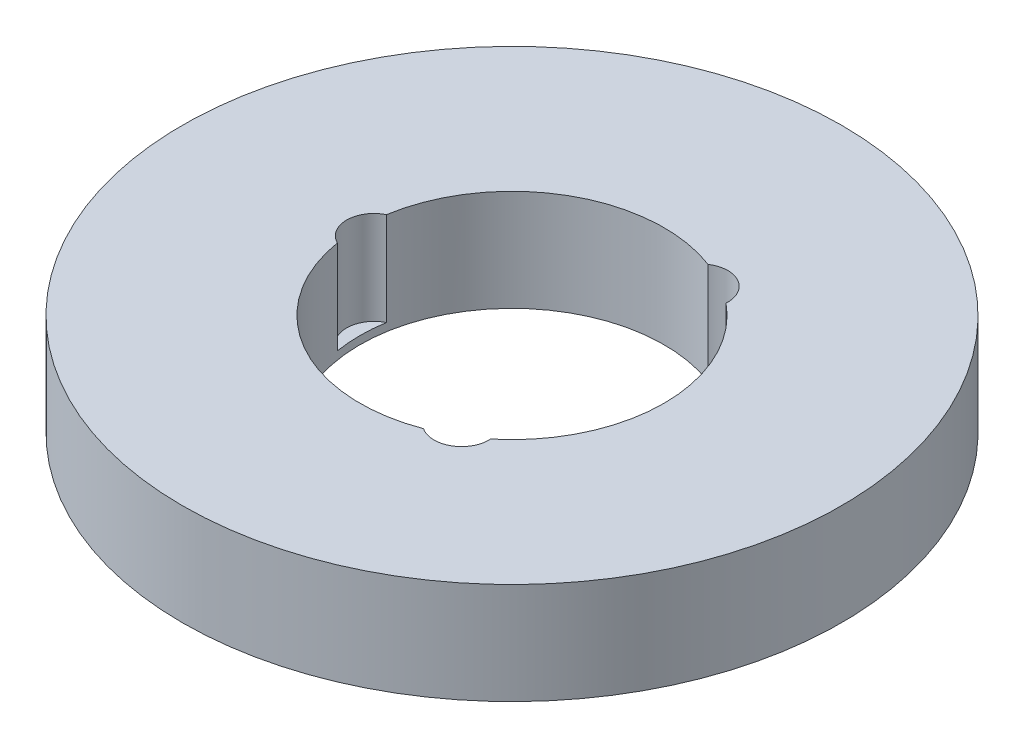
ISO-10303-21;
HEADER;
FILE_DESCRIPTION(('STEP AP214'),'2;1');
FILE_NAME('part.step','',(''),(''),'','','');
FILE_SCHEMA(('AUTOMOTIVE_DESIGN { 1 0 10303 214 1 1 1 1 }'));
ENDSEC;
DATA;
#1=APPLICATION_CONTEXT('core data for automotive mechanical design processes');
#2=APPLICATION_PROTOCOL_DEFINITION('international standard','automotive_design',2000,#1);
#3=PRODUCT_CONTEXT('',#1,'mechanical');
#4=PRODUCT('Part','Part','',(#3));
#5=PRODUCT_RELATED_PRODUCT_CATEGORY('part','',(#4));
#6=PRODUCT_DEFINITION_FORMATION('','',#4);
#7=PRODUCT_DEFINITION_CONTEXT('part definition',#1,'design');
#8=PRODUCT_DEFINITION('design','',#6,#7);
#9=PRODUCT_DEFINITION_SHAPE('','',#8);
#10=(LENGTH_UNIT() NAMED_UNIT(*) SI_UNIT(.MILLI.,.METRE.));
#11=(NAMED_UNIT(*) PLANE_ANGLE_UNIT() SI_UNIT($,.RADIAN.));
#12=(NAMED_UNIT(*) SI_UNIT($,.STERADIAN.) SOLID_ANGLE_UNIT());
#13=UNCERTAINTY_MEASURE_WITH_UNIT(LENGTH_MEASURE(1.E-05),#10,'distance_accuracy_value','');
#14=(GEOMETRIC_REPRESENTATION_CONTEXT(3) GLOBAL_UNCERTAINTY_ASSIGNED_CONTEXT((#13)) GLOBAL_UNIT_ASSIGNED_CONTEXT((#10,
#11,#12)) REPRESENTATION_CONTEXT('',''));
#15=CARTESIAN_POINT('',(0.,0.,0.));
#16=DIRECTION('',(0.,0.,1.));
#17=DIRECTION('',(1.,0.,0.));
#18=AXIS2_PLACEMENT_3D('',#15,#16,#17);
#19=CARTESIAN_POINT('',(0.,30.,0.));
#20=DIRECTION('',(0.,-1.,0.));
#21=DIRECTION('',(0.,0.,-1.));
#22=AXIS2_PLACEMENT_3D('',#19,#20,#21);
#23=CYLINDRICAL_SURFACE('',#22,97.5);
#24=CARTESIAN_POINT('',(0.,30.,0.));
#25=DIRECTION('',(0.,1.,0.));
#26=DIRECTION('',(0.,0.,1.));
#27=AXIS2_PLACEMENT_3D('',#24,#25,#26);
#28=CIRCLE('',#27,97.5);
#29=CARTESIAN_POINT('',(0.,30.,97.5));
#30=VERTEX_POINT('',#29);
#31=EDGE_CURVE('E130',#30,#30,#28,.T.);
#32=ORIENTED_EDGE('',*,*,#31,.F.);
#33=EDGE_LOOP('',(#32));
#34=FACE_BOUND('',#33,.T.);
#35=CARTESIAN_POINT('',(0.,0.,0.));
#36=DIRECTION('',(0.,1.,0.));
#37=DIRECTION('',(0.,0.,1.));
#38=AXIS2_PLACEMENT_3D('',#35,#36,#37);
#39=CIRCLE('',#38,97.5);
#40=CARTESIAN_POINT('',(0.,0.,97.5));
#41=VERTEX_POINT('',#40);
#42=EDGE_CURVE('E117',#41,#41,#39,.T.);
#43=ORIENTED_EDGE('',*,*,#42,.T.);
#44=EDGE_LOOP('',(#43));
#45=FACE_BOUND('',#44,.T.);
#46=ADVANCED_FACE('F39',(#34,#45),#23,.T.);
#47=CARTESIAN_POINT('',(0.,30.,0.));
#48=DIRECTION('',(0.,1.,0.));
#49=DIRECTION('',(0.,0.,1.));
#50=AXIS2_PLACEMENT_3D('',#47,#48,#49);
#51=PLANE('',#50);
#52=CARTESIAN_POINT('',(20.4074353626801,30.,35.3467149003394));
#53=DIRECTION('',(0.,1.,0.));
#54=DIRECTION('',(0.866025403784436,0.,-0.500000000000004));
#55=AXIS2_PLACEMENT_3D('',#52,#53,#54);
#56=CIRCLE('',#55,8.10501321450166);
#57=CARTESIAN_POINT('',(15.9139927366364,30.,42.092099438948));
#58=VERTEX_POINT('',#57);
#59=CARTESIAN_POINT('',(28.4958310444318,30.,34.8279717050419));
#60=VERTEX_POINT('',#59);
#61=EDGE_CURVE('E148',#58,#60,#56,.T.);
#62=ORIENTED_EDGE('',*,*,#61,.F.);
#63=CARTESIAN_POINT('',(0.,30.,0.));
#64=DIRECTION('',(0.,1.,0.));
#65=DIRECTION('',(0.,0.,1.));
#66=AXIS2_PLACEMENT_3D('',#63,#64,#65);
#67=CIRCLE('',#66,45.);
#68=CARTESIAN_POINT('',(-44.4098237810678,30.,7.26412773390601));
#69=VERTEX_POINT('',#68);
#70=EDGE_CURVE('E113',#69,#58,#67,.T.);
#71=ORIENTED_EDGE('',*,*,#70,.F.);
#72=CARTESIAN_POINT('',(-40.8148707253599,30.,0.));
#73=DIRECTION('',(0.,1.,0.));
#74=DIRECTION('',(0.,0.,1.));
#75=AXIS2_PLACEMENT_3D('',#72,#73,#74);
#76=CIRCLE('',#75,8.10501321450166);
#77=CARTESIAN_POINT('',(-44.4098237810678,30.,-7.26412773390601));
#78=VERTEX_POINT('',#77);
#79=EDGE_CURVE('E125',#78,#69,#76,.T.);
#80=ORIENTED_EDGE('',*,*,#79,.F.);
#81=CARTESIAN_POINT('',(15.9139927366358,30.,-42.0920994389482));
#82=VERTEX_POINT('',#81);
#83=EDGE_CURVE('E107',#82,#78,#67,.T.);
#84=ORIENTED_EDGE('',*,*,#83,.F.);
#85=CARTESIAN_POINT('',(20.4074353626796,30.,-35.3467149003396));
#86=DIRECTION('',(0.,1.,0.));
#87=DIRECTION('',(-0.866025403784443,0.,-0.499999999999992));
#88=AXIS2_PLACEMENT_3D('',#85,#86,#87);
#89=CIRCLE('',#88,8.10501321450166);
#90=CARTESIAN_POINT('',(28.4958310444313,30.,-34.8279717050423));
#91=VERTEX_POINT('',#90);
#92=EDGE_CURVE('E95',#91,#82,#89,.T.);
#93=ORIENTED_EDGE('',*,*,#92,.F.);
#94=EDGE_CURVE('E106',#60,#91,#67,.T.);
#95=ORIENTED_EDGE('',*,*,#94,.F.);
#96=EDGE_LOOP('',(#62,#71,#80,#84,#93,#95));
#97=FACE_BOUND('',#96,.T.);
#98=ORIENTED_EDGE('',*,*,#31,.T.);
#99=EDGE_LOOP('',(#98));
#100=FACE_BOUND('',#99,.T.);
#101=ADVANCED_FACE('F102',(#97,#100),#51,.T.);
#102=CARTESIAN_POINT('',(0.,0.,0.));
#103=DIRECTION('',(0.,1.,0.));
#104=DIRECTION('',(0.,0.,1.));
#105=AXIS2_PLACEMENT_3D('',#102,#103,#104);
#106=PLANE('',#105);
#107=CARTESIAN_POINT('',(0.,0.,0.));
#108=DIRECTION('',(0.,1.,0.));
#109=DIRECTION('',(0.,0.,1.));
#110=AXIS2_PLACEMENT_3D('',#107,#108,#109);
#111=CIRCLE('',#110,45.);
#112=CARTESIAN_POINT('',(0.,0.,45.));
#113=VERTEX_POINT('',#112);
#114=EDGE_CURVE('E118',#113,#113,#111,.T.);
#115=ORIENTED_EDGE('',*,*,#114,.T.);
#116=EDGE_LOOP('',(#115));
#117=FACE_BOUND('',#116,.T.);
#118=ORIENTED_EDGE('',*,*,#42,.F.);
#119=EDGE_LOOP('',(#118));
#120=FACE_BOUND('',#119,.T.);
#121=ADVANCED_FACE('F161',(#117,#120),#106,.F.);
#122=CARTESIAN_POINT('',(0.,30.,0.));
#123=DIRECTION('',(0.,-1.,0.));
#124=DIRECTION('',(0.,0.,-1.));
#125=AXIS2_PLACEMENT_3D('',#122,#123,#124);
#126=CYLINDRICAL_SURFACE('',#125,45.);
#127=DIRECTION('',(0.,1.,0.));
#128=VECTOR('',#127,1.);
#129=CARTESIAN_POINT('',(15.9139927366364,16.174575367588,42.092099438948));
#130=LINE('',#129,#128);
#131=CARTESIAN_POINT('',(15.9139927366364,2.34915073517608,42.092099438948));
#132=VERTEX_POINT('',#131);
#133=EDGE_CURVE('E11',#132,#58,#130,.T.);
#134=ORIENTED_EDGE('',*,*,#133,.F.);
#135=CARTESIAN_POINT('',(0.,2.34915073517608,0.));
#136=DIRECTION('',(0.,1.,0.));
#137=DIRECTION('',(0.,0.,1.));
#138=AXIS2_PLACEMENT_3D('',#135,#136,#137);
#139=CIRCLE('',#138,45.);
#140=CARTESIAN_POINT('',(28.4958310444318,2.34915073517608,34.8279717050419));
#141=VERTEX_POINT('',#140);
#142=EDGE_CURVE('E100',#132,#141,#139,.T.);
#143=ORIENTED_EDGE('',*,*,#142,.T.);
#144=DIRECTION('',(0.,1.,0.));
#145=VECTOR('',#144,1.);
#146=CARTESIAN_POINT('',(28.4958310444318,16.174575367588,34.8279717050419));
#147=LINE('',#146,#145);
#148=EDGE_CURVE('E46',#60,#141,#147,.F.);
#149=ORIENTED_EDGE('',*,*,#148,.F.);
#150=ORIENTED_EDGE('',*,*,#94,.T.);
#151=DIRECTION('',(0.,1.,0.));
#152=VECTOR('',#151,1.);
#153=CARTESIAN_POINT('',(28.4958310444313,16.174575367588,-34.8279717050423));
#154=LINE('',#153,#152);
#155=CARTESIAN_POINT('',(28.4958310444313,2.34915073517608,-34.8279717050423));
#156=VERTEX_POINT('',#155);
#157=EDGE_CURVE('E90',#156,#91,#154,.T.);
#158=ORIENTED_EDGE('',*,*,#157,.F.);
#159=CARTESIAN_POINT('',(0.,2.34915073517608,0.));
#160=DIRECTION('',(0.,1.,0.));
#161=DIRECTION('',(0.,0.,1.));
#162=AXIS2_PLACEMENT_3D('',#159,#160,#161);
#163=CIRCLE('',#162,45.);
#164=CARTESIAN_POINT('',(15.9139927366358,2.34915073517608,-42.0920994389482));
#165=VERTEX_POINT('',#164);
#166=EDGE_CURVE('E143',#156,#165,#163,.T.);
#167=ORIENTED_EDGE('',*,*,#166,.T.);
#168=DIRECTION('',(0.,1.,0.));
#169=VECTOR('',#168,1.);
#170=CARTESIAN_POINT('',(15.9139927366359,16.174575367588,-42.0920994389482));
#171=LINE('',#170,#169);
#172=EDGE_CURVE('E98',#82,#165,#171,.F.);
#173=ORIENTED_EDGE('',*,*,#172,.F.);
#174=ORIENTED_EDGE('',*,*,#83,.T.);
#175=DIRECTION('',(0.,1.,0.));
#176=VECTOR('',#175,1.);
#177=CARTESIAN_POINT('',(-44.4098237810678,16.174575367588,-7.264127733906));
#178=LINE('',#177,#176);
#179=CARTESIAN_POINT('',(-44.4098237810678,2.34915073517608,-7.26412773390601));
#180=VERTEX_POINT('',#179);
#181=EDGE_CURVE('E137',#180,#78,#178,.T.);
#182=ORIENTED_EDGE('',*,*,#181,.F.);
#183=CARTESIAN_POINT('',(0.,2.34915073517608,0.));
#184=DIRECTION('',(0.,1.,0.));
#185=DIRECTION('',(0.,0.,1.));
#186=AXIS2_PLACEMENT_3D('',#183,#184,#185);
#187=CIRCLE('',#186,45.);
#188=CARTESIAN_POINT('',(-44.4098237810678,2.34915073517608,7.26412773390601));
#189=VERTEX_POINT('',#188);
#190=EDGE_CURVE('E128',#180,#189,#187,.T.);
#191=ORIENTED_EDGE('',*,*,#190,.T.);
#192=DIRECTION('',(0.,1.,0.));
#193=VECTOR('',#192,1.);
#194=CARTESIAN_POINT('',(-44.4098237810678,16.174575367588,7.264127733906));
#195=LINE('',#194,#193);
#196=EDGE_CURVE('E134',#69,#189,#195,.F.);
#197=ORIENTED_EDGE('',*,*,#196,.F.);
#198=ORIENTED_EDGE('',*,*,#70,.T.);
#199=EDGE_LOOP('',(#134,#143,#149,#150,#158,#167,#173,#174,#182,#191,#197,#198));
#200=FACE_BOUND('',#199,.T.);
#201=ORIENTED_EDGE('',*,*,#114,.F.);
#202=EDGE_LOOP('',(#201));
#203=FACE_BOUND('',#202,.T.);
#204=ADVANCED_FACE('F115',(#200,#203),#126,.F.);
#205=CARTESIAN_POINT('',(-40.8148707253599,2.34915073517608,0.));
#206=DIRECTION('',(0.,1.,0.));
#207=DIRECTION('',(0.,0.,1.));
#208=AXIS2_PLACEMENT_3D('',#205,#206,#207);
#209=CYLINDRICAL_SURFACE('',#208,8.10501321450166);
#210=ORIENTED_EDGE('',*,*,#181,.T.);
#211=ORIENTED_EDGE('',*,*,#79,.T.);
#212=ORIENTED_EDGE('',*,*,#196,.T.);
#213=CARTESIAN_POINT('',(-40.8148707253599,2.34915073517608,0.));
#214=DIRECTION('',(0.,1.,0.));
#215=DIRECTION('',(0.,0.,1.));
#216=AXIS2_PLACEMENT_3D('',#213,#214,#215);
#217=CIRCLE('',#216,8.10501321450166);
#218=EDGE_CURVE('E127',#180,#189,#217,.T.);
#219=ORIENTED_EDGE('',*,*,#218,.F.);
#220=EDGE_LOOP('',(#210,#211,#212,#219));
#221=FACE_BOUND('',#220,.T.);
#222=ADVANCED_FACE('F175',(#221),#209,.F.);
#223=CARTESIAN_POINT('',(-40.8148707253599,2.34915073517608,0.));
#224=DIRECTION('',(0.,1.,0.));
#225=DIRECTION('',(0.,0.,1.));
#226=AXIS2_PLACEMENT_3D('',#223,#224,#225);
#227=PLANE('',#226);
#228=ORIENTED_EDGE('',*,*,#218,.T.);
#229=ORIENTED_EDGE('',*,*,#190,.F.);
#230=EDGE_LOOP('',(#228,#229));
#231=FACE_BOUND('',#230,.T.);
#232=ADVANCED_FACE('F176',(#231),#227,.T.);
#233=CARTESIAN_POINT('',(20.4074353626796,2.34915073517608,-35.3467149003396));
#234=DIRECTION('',(0.,1.,0.));
#235=DIRECTION('',(0.,0.,1.));
#236=AXIS2_PLACEMENT_3D('',#233,#234,#235);
#237=CYLINDRICAL_SURFACE('',#236,8.10501321450166);
#238=ORIENTED_EDGE('',*,*,#157,.T.);
#239=ORIENTED_EDGE('',*,*,#92,.T.);
#240=ORIENTED_EDGE('',*,*,#172,.T.);
#241=CARTESIAN_POINT('',(20.4074353626796,2.34915073517608,-35.3467149003396));
#242=DIRECTION('',(0.,1.,0.));
#243=DIRECTION('',(-0.866025403784443,0.,-0.499999999999992));
#244=AXIS2_PLACEMENT_3D('',#241,#242,#243);
#245=CIRCLE('',#244,8.10501321450166);
#246=EDGE_CURVE('E56',#156,#165,#245,.T.);
#247=ORIENTED_EDGE('',*,*,#246,.F.);
#248=EDGE_LOOP('',(#238,#239,#240,#247));
#249=FACE_BOUND('',#248,.T.);
#250=ADVANCED_FACE('F93',(#249),#237,.F.);
#251=CARTESIAN_POINT('',(20.4074353626796,2.34915073517608,-35.3467149003396));
#252=DIRECTION('',(0.,1.,0.));
#253=DIRECTION('',(-0.866025403784443,0.,-0.499999999999992));
#254=AXIS2_PLACEMENT_3D('',#251,#252,#253);
#255=PLANE('',#254);
#256=ORIENTED_EDGE('',*,*,#246,.T.);
#257=ORIENTED_EDGE('',*,*,#166,.F.);
#258=EDGE_LOOP('',(#256,#257));
#259=FACE_BOUND('',#258,.T.);
#260=ADVANCED_FACE('F153',(#259),#255,.T.);
#261=CARTESIAN_POINT('',(20.4074353626801,2.34915073517608,35.3467149003394));
#262=DIRECTION('',(0.,1.,0.));
#263=DIRECTION('',(0.,0.,1.));
#264=AXIS2_PLACEMENT_3D('',#261,#262,#263);
#265=CYLINDRICAL_SURFACE('',#264,8.10501321450166);
#266=ORIENTED_EDGE('',*,*,#133,.T.);
#267=ORIENTED_EDGE('',*,*,#61,.T.);
#268=ORIENTED_EDGE('',*,*,#148,.T.);
#269=CARTESIAN_POINT('',(20.4074353626801,2.34915073517608,35.3467149003394));
#270=DIRECTION('',(0.,1.,0.));
#271=DIRECTION('',(0.866025403784436,0.,-0.500000000000004));
#272=AXIS2_PLACEMENT_3D('',#269,#270,#271);
#273=CIRCLE('',#272,8.10501321450166);
#274=EDGE_CURVE('E55',#132,#141,#273,.T.);
#275=ORIENTED_EDGE('',*,*,#274,.F.);
#276=EDGE_LOOP('',(#266,#267,#268,#275));
#277=FACE_BOUND('',#276,.T.);
#278=ADVANCED_FACE('F144',(#277),#265,.F.);
#279=CARTESIAN_POINT('',(20.4074353626801,2.34915073517608,35.3467149003394));
#280=DIRECTION('',(0.,1.,0.));
#281=DIRECTION('',(0.866025403784436,0.,-0.500000000000004));
#282=AXIS2_PLACEMENT_3D('',#279,#280,#281);
#283=PLANE('',#282);
#284=ORIENTED_EDGE('',*,*,#274,.T.);
#285=ORIENTED_EDGE('',*,*,#142,.F.);
#286=EDGE_LOOP('',(#284,#285));
#287=FACE_BOUND('',#286,.T.);
#288=ADVANCED_FACE('F150',(#287),#283,.T.);
#289=CLOSED_SHELL('',(#46,#101,#121,#204,#222,#232,#250,#260,#278,#288));
#290=MANIFOLD_SOLID_BREP('B2',#289);
#291=ADVANCED_BREP_SHAPE_REPRESENTATION('',(#18,#290),#14);
#292=SHAPE_DEFINITION_REPRESENTATION(#9,#291);
ENDSEC;
END-ISO-10303-21;
